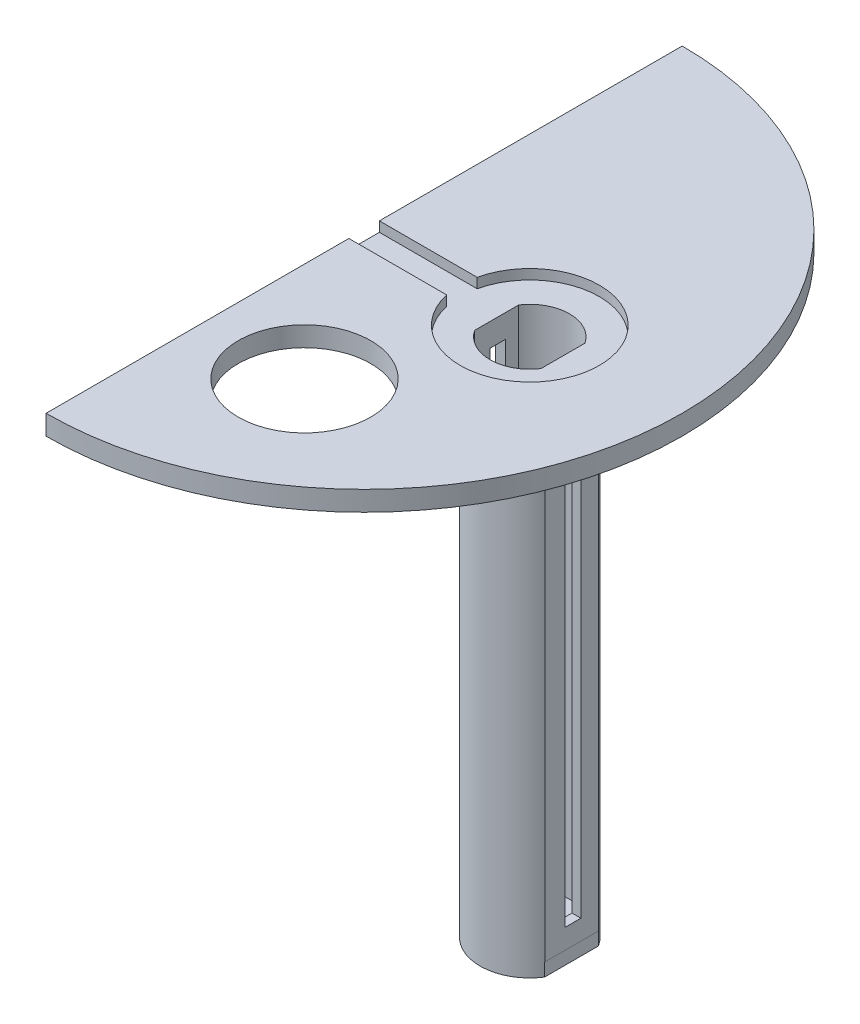
ISO-10303-21;
HEADER;
FILE_DESCRIPTION(('STEP AP214'),'2;1');
FILE_NAME('part.step','',(''),(''),'','','');
FILE_SCHEMA(('AUTOMOTIVE_DESIGN { 1 0 10303 214 1 1 1 1 }'));
ENDSEC;
DATA;
#1=APPLICATION_CONTEXT('core data for automotive mechanical design processes');
#2=APPLICATION_PROTOCOL_DEFINITION('international standard','automotive_design',2000,#1);
#3=PRODUCT_CONTEXT('',#1,'mechanical');
#4=PRODUCT('Part','Part','',(#3));
#5=PRODUCT_RELATED_PRODUCT_CATEGORY('part','',(#4));
#6=PRODUCT_DEFINITION_FORMATION('','',#4);
#7=PRODUCT_DEFINITION_CONTEXT('part definition',#1,'design');
#8=PRODUCT_DEFINITION('design','',#6,#7);
#9=PRODUCT_DEFINITION_SHAPE('','',#8);
#10=(LENGTH_UNIT() NAMED_UNIT(*) SI_UNIT(.MILLI.,.METRE.));
#11=(NAMED_UNIT(*) PLANE_ANGLE_UNIT() SI_UNIT($,.RADIAN.));
#12=(NAMED_UNIT(*) SI_UNIT($,.STERADIAN.) SOLID_ANGLE_UNIT());
#13=UNCERTAINTY_MEASURE_WITH_UNIT(LENGTH_MEASURE(1.E-05),#10,'distance_accuracy_value','');
#14=(GEOMETRIC_REPRESENTATION_CONTEXT(3) GLOBAL_UNCERTAINTY_ASSIGNED_CONTEXT((#13)) GLOBAL_UNIT_ASSIGNED_CONTEXT((#10,
#11,#12)) REPRESENTATION_CONTEXT('',''));
#15=CARTESIAN_POINT('',(0.,0.,0.));
#16=DIRECTION('',(0.,0.,1.));
#17=DIRECTION('',(1.,0.,0.));
#18=AXIS2_PLACEMENT_3D('',#15,#16,#17);
#19=CARTESIAN_POINT('',(0.,0.,0.));
#20=DIRECTION('',(0.,1.,0.));
#21=DIRECTION('',(0.,0.,1.));
#22=AXIS2_PLACEMENT_3D('',#19,#20,#21);
#23=PLANE('',#22);
#24=CARTESIAN_POINT('',(15.,0.,24.));
#25=DIRECTION('',(0.,1.,0.));
#26=DIRECTION('',(0.,0.,1.));
#27=AXIS2_PLACEMENT_3D('',#24,#25,#26);
#28=CIRCLE('',#27,10.);
#29=CARTESIAN_POINT('',(15.,0.,34.));
#30=VERTEX_POINT('',#29);
#31=EDGE_CURVE('E462',#30,#30,#28,.T.);
#32=ORIENTED_EDGE('',*,*,#31,.T.);
#33=EDGE_LOOP('',(#32));
#34=FACE_BOUND('',#33,.T.);
#35=CARTESIAN_POINT('',(0.,0.,0.));
#36=DIRECTION('',(0.,1.,0.));
#37=DIRECTION('',(0.,0.,1.));
#38=AXIS2_PLACEMENT_3D('',#35,#36,#37);
#39=CIRCLE('',#38,48.);
#40=CARTESIAN_POINT('',(0.,0.,48.));
#41=VERTEX_POINT('',#40);
#42=CARTESIAN_POINT('',(0.,0.,-48.));
#43=VERTEX_POINT('',#42);
#44=EDGE_CURVE('E391',#41,#43,#39,.T.);
#45=ORIENTED_EDGE('',*,*,#44,.F.);
#46=DIRECTION('',(0.,0.,1.));
#47=VECTOR('',#46,1.);
#48=CARTESIAN_POINT('',(0.,0.,-48.));
#49=LINE('',#48,#47);
#50=EDGE_CURVE('E401',#43,#41,#49,.T.);
#51=ORIENTED_EDGE('',*,*,#50,.F.);
#52=EDGE_LOOP('',(#45,#51));
#53=FACE_BOUND('',#52,.T.);
#54=CARTESIAN_POINT('',(25.,0.,0.));
#55=DIRECTION('',(0.,-1.,0.));
#56=DIRECTION('',(0.,0.,-1.));
#57=AXIS2_PLACEMENT_3D('',#54,#55,#56);
#58=CIRCLE('',#57,7.5);
#59=CARTESIAN_POINT('',(31.3390528314233,0.,4.0082925542461));
#60=VERTEX_POINT('',#59);
#61=CARTESIAN_POINT('',(18.4235497717257,0.,3.60559320986589));
#62=VERTEX_POINT('',#61);
#63=EDGE_CURVE('E328',#60,#62,#58,.T.);
#64=ORIENTED_EDGE('',*,*,#63,.F.);
#65=DIRECTION('',(0.,0.,-1.));
#66=VECTOR('',#65,1.);
#67=CARTESIAN_POINT('',(31.3390528314233,0.,0.));
#68=LINE('',#67,#66);
#69=CARTESIAN_POINT('',(31.3390528314233,0.,-4.0082925542461));
#70=VERTEX_POINT('',#69);
#71=EDGE_CURVE('E302',#60,#70,#68,.T.);
#72=ORIENTED_EDGE('',*,*,#71,.T.);
#73=CARTESIAN_POINT('',(25.,0.,0.));
#74=DIRECTION('',(0.,-1.,0.));
#75=DIRECTION('',(0.,0.,-1.));
#76=AXIS2_PLACEMENT_3D('',#73,#74,#75);
#77=CIRCLE('',#76,7.5);
#78=CARTESIAN_POINT('',(18.4235497717257,0.,-3.60559320986589));
#79=VERTEX_POINT('',#78);
#80=EDGE_CURVE('E307',#79,#70,#77,.T.);
#81=ORIENTED_EDGE('',*,*,#80,.F.);
#82=DIRECTION('',(0.,0.,-1.));
#83=VECTOR('',#82,1.);
#84=CARTESIAN_POINT('',(18.4235497717257,0.,0.));
#85=LINE('',#84,#83);
#86=EDGE_CURVE('E331',#62,#79,#85,.T.);
#87=ORIENTED_EDGE('',*,*,#86,.F.);
#88=EDGE_LOOP('',(#64,#72,#81,#87));
#89=FACE_BOUND('',#88,.T.);
#90=ADVANCED_FACE('F34',(#34,#53,#89),#23,.F.);
#91=CARTESIAN_POINT('',(0.,3.,0.));
#92=DIRECTION('',(0.,-1.,0.));
#93=DIRECTION('',(0.,0.,-1.));
#94=AXIS2_PLACEMENT_3D('',#91,#92,#93);
#95=CYLINDRICAL_SURFACE('',#94,48.);
#96=ORIENTED_EDGE('',*,*,#44,.T.);
#97=DIRECTION('',(0.,-1.,0.));
#98=VECTOR('',#97,1.);
#99=CARTESIAN_POINT('',(0.,3.,-48.));
#100=LINE('',#99,#98);
#101=CARTESIAN_POINT('',(0.,3.,-48.));
#102=VERTEX_POINT('',#101);
#103=EDGE_CURVE('E11',#102,#43,#100,.T.);
#104=ORIENTED_EDGE('',*,*,#103,.F.);
#105=CARTESIAN_POINT('',(0.,3.,0.));
#106=DIRECTION('',(0.,1.,0.));
#107=DIRECTION('',(0.,0.,1.));
#108=AXIS2_PLACEMENT_3D('',#105,#106,#107);
#109=CIRCLE('',#108,48.);
#110=CARTESIAN_POINT('',(0.,3.,48.));
#111=VERTEX_POINT('',#110);
#112=EDGE_CURVE('E397',#111,#102,#109,.T.);
#113=ORIENTED_EDGE('',*,*,#112,.F.);
#114=DIRECTION('',(0.,-1.,0.));
#115=VECTOR('',#114,1.);
#116=CARTESIAN_POINT('',(0.,3.,48.));
#117=LINE('',#116,#115);
#118=EDGE_CURVE('E42',#111,#41,#117,.T.);
#119=ORIENTED_EDGE('',*,*,#118,.T.);
#120=EDGE_LOOP('',(#96,#104,#113,#119));
#121=FACE_BOUND('',#120,.T.);
#122=ADVANCED_FACE('F36',(#121),#95,.T.);
#123=CARTESIAN_POINT('',(0.,3.,-48.));
#124=DIRECTION('',(1.,0.,0.));
#125=DIRECTION('',(0.,0.,-1.));
#126=AXIS2_PLACEMENT_3D('',#123,#124,#125);
#127=PLANE('',#126);
#128=DIRECTION('',(0.,0.,1.));
#129=VECTOR('',#128,1.);
#130=CARTESIAN_POINT('',(0.,1.5,-2.3));
#131=LINE('',#130,#129);
#132=CARTESIAN_POINT('',(0.,1.5,-2.3));
#133=VERTEX_POINT('',#132);
#134=CARTESIAN_POINT('',(0.,1.5,2.3));
#135=VERTEX_POINT('',#134);
#136=EDGE_CURVE('E368',#133,#135,#131,.T.);
#137=ORIENTED_EDGE('',*,*,#136,.F.);
#138=DIRECTION('',(0.,1.,0.));
#139=VECTOR('',#138,1.);
#140=CARTESIAN_POINT('',(0.,1.5,-2.3));
#141=LINE('',#140,#139);
#142=CARTESIAN_POINT('',(0.,3.,-2.3));
#143=VERTEX_POINT('',#142);
#144=EDGE_CURVE('E388',#133,#143,#141,.T.);
#145=ORIENTED_EDGE('',*,*,#144,.T.);
#146=DIRECTION('',(0.,0.,1.));
#147=VECTOR('',#146,1.);
#148=CARTESIAN_POINT('',(0.,3.,-48.));
#149=LINE('',#148,#147);
#150=EDGE_CURVE('E402',#102,#143,#149,.T.);
#151=ORIENTED_EDGE('',*,*,#150,.F.);
#152=ORIENTED_EDGE('',*,*,#103,.T.);
#153=ORIENTED_EDGE('',*,*,#50,.T.);
#154=ORIENTED_EDGE('',*,*,#118,.F.);
#155=CARTESIAN_POINT('',(0.,3.,2.3));
#156=VERTEX_POINT('',#155);
#157=EDGE_CURVE('E400',#156,#111,#149,.T.);
#158=ORIENTED_EDGE('',*,*,#157,.F.);
#159=DIRECTION('',(0.,1.,0.));
#160=VECTOR('',#159,1.);
#161=CARTESIAN_POINT('',(0.,1.5,2.3));
#162=LINE('',#161,#160);
#163=EDGE_CURVE('E381',#135,#156,#162,.T.);
#164=ORIENTED_EDGE('',*,*,#163,.F.);
#165=EDGE_LOOP('',(#137,#145,#151,#152,#153,#154,#158,#164));
#166=FACE_BOUND('',#165,.T.);
#167=ADVANCED_FACE('F418',(#166),#127,.F.);
#168=CARTESIAN_POINT('',(0.,3.,0.));
#169=DIRECTION('',(0.,1.,0.));
#170=DIRECTION('',(0.,0.,1.));
#171=AXIS2_PLACEMENT_3D('',#168,#169,#170);
#172=PLANE('',#171);
#173=CARTESIAN_POINT('',(15.,3.,24.));
#174=DIRECTION('',(0.,1.,0.));
#175=DIRECTION('',(0.,0.,1.));
#176=AXIS2_PLACEMENT_3D('',#173,#174,#175);
#177=CIRCLE('',#176,10.);
#178=CARTESIAN_POINT('',(15.,3.,34.));
#179=VERTEX_POINT('',#178);
#180=EDGE_CURVE('E460',#179,#179,#177,.T.);
#181=ORIENTED_EDGE('',*,*,#180,.F.);
#182=EDGE_LOOP('',(#181));
#183=FACE_BOUND('',#182,.T.);
#184=DIRECTION('',(-1.,0.,0.));
#185=VECTOR('',#184,1.);
#186=CARTESIAN_POINT('',(14.7550012201075,3.,-2.3));
#187=LINE('',#186,#185);
#188=CARTESIAN_POINT('',(14.7550012201075,3.,-2.3));
#189=VERTEX_POINT('',#188);
#190=EDGE_CURVE('E372',#189,#143,#187,.T.);
#191=ORIENTED_EDGE('',*,*,#190,.F.);
#192=CARTESIAN_POINT('',(25.,3.,0.));
#193=DIRECTION('',(0.,1.,0.));
#194=DIRECTION('',(0.,0.,1.));
#195=AXIS2_PLACEMENT_3D('',#192,#193,#194);
#196=CIRCLE('',#195,10.5);
#197=CARTESIAN_POINT('',(14.7550012201074,3.,2.3));
#198=VERTEX_POINT('',#197);
#199=EDGE_CURVE('E384',#198,#189,#196,.T.);
#200=ORIENTED_EDGE('',*,*,#199,.F.);
#201=DIRECTION('',(1.,0.,0.));
#202=VECTOR('',#201,1.);
#203=CARTESIAN_POINT('',(14.7550012201075,3.,2.3));
#204=LINE('',#203,#202);
#205=EDGE_CURVE('E361',#156,#198,#204,.T.);
#206=ORIENTED_EDGE('',*,*,#205,.F.);
#207=ORIENTED_EDGE('',*,*,#157,.T.);
#208=ORIENTED_EDGE('',*,*,#112,.T.);
#209=ORIENTED_EDGE('',*,*,#150,.T.);
#210=EDGE_LOOP('',(#191,#200,#206,#207,#208,#209));
#211=FACE_BOUND('',#210,.T.);
#212=ADVANCED_FACE('F421',(#183,#211),#172,.T.);
#213=CARTESIAN_POINT('',(14.7550012201075,1.5,-2.3));
#214=DIRECTION('',(0.,0.,-1.));
#215=DIRECTION('',(-1.,0.,0.));
#216=AXIS2_PLACEMENT_3D('',#213,#214,#215);
#217=PLANE('',#216);
#218=ORIENTED_EDGE('',*,*,#190,.T.);
#219=ORIENTED_EDGE('',*,*,#144,.F.);
#220=DIRECTION('',(-1.,0.,0.));
#221=VECTOR('',#220,1.);
#222=CARTESIAN_POINT('',(14.7550012201075,1.5,-2.3));
#223=LINE('',#222,#221);
#224=CARTESIAN_POINT('',(14.7550012201075,1.5,-2.3));
#225=VERTEX_POINT('',#224);
#226=EDGE_CURVE('E378',#225,#133,#223,.T.);
#227=ORIENTED_EDGE('',*,*,#226,.F.);
#228=DIRECTION('',(0.,1.,0.));
#229=VECTOR('',#228,1.);
#230=CARTESIAN_POINT('',(14.7550012201075,1.5,-2.3));
#231=LINE('',#230,#229);
#232=EDGE_CURVE('E392',#225,#189,#231,.T.);
#233=ORIENTED_EDGE('',*,*,#232,.T.);
#234=EDGE_LOOP('',(#218,#219,#227,#233));
#235=FACE_BOUND('',#234,.T.);
#236=ADVANCED_FACE('F432',(#235),#217,.F.);
#237=CARTESIAN_POINT('',(25.,1.5,0.));
#238=DIRECTION('',(0.,1.,0.));
#239=DIRECTION('',(0.,0.,1.));
#240=AXIS2_PLACEMENT_3D('',#237,#238,#239);
#241=CYLINDRICAL_SURFACE('',#240,10.5);
#242=ORIENTED_EDGE('',*,*,#199,.T.);
#243=ORIENTED_EDGE('',*,*,#232,.F.);
#244=CARTESIAN_POINT('',(25.,1.5,0.));
#245=DIRECTION('',(0.,1.,0.));
#246=DIRECTION('',(0.,0.,1.));
#247=AXIS2_PLACEMENT_3D('',#244,#245,#246);
#248=CIRCLE('',#247,10.5);
#249=CARTESIAN_POINT('',(14.7550012201074,1.5,2.3));
#250=VERTEX_POINT('',#249);
#251=EDGE_CURVE('E375',#250,#225,#248,.T.);
#252=ORIENTED_EDGE('',*,*,#251,.F.);
#253=DIRECTION('',(0.,1.,0.));
#254=VECTOR('',#253,1.);
#255=CARTESIAN_POINT('',(14.7550012201074,1.5,2.3));
#256=LINE('',#255,#254);
#257=EDGE_CURVE('E394',#250,#198,#256,.T.);
#258=ORIENTED_EDGE('',*,*,#257,.T.);
#259=EDGE_LOOP('',(#242,#243,#252,#258));
#260=FACE_BOUND('',#259,.T.);
#261=ADVANCED_FACE('F434',(#260),#241,.F.);
#262=CARTESIAN_POINT('',(14.7550012201075,1.5,2.3));
#263=DIRECTION('',(0.,0.,1.));
#264=DIRECTION('',(1.,0.,0.));
#265=AXIS2_PLACEMENT_3D('',#262,#263,#264);
#266=PLANE('',#265);
#267=ORIENTED_EDGE('',*,*,#205,.T.);
#268=ORIENTED_EDGE('',*,*,#257,.F.);
#269=DIRECTION('',(1.,0.,0.));
#270=VECTOR('',#269,1.);
#271=CARTESIAN_POINT('',(14.7550012201075,1.5,2.3));
#272=LINE('',#271,#270);
#273=EDGE_CURVE('E371',#135,#250,#272,.T.);
#274=ORIENTED_EDGE('',*,*,#273,.F.);
#275=ORIENTED_EDGE('',*,*,#163,.T.);
#276=EDGE_LOOP('',(#267,#268,#274,#275));
#277=FACE_BOUND('',#276,.T.);
#278=ADVANCED_FACE('F426',(#277),#266,.F.);
#279=CARTESIAN_POINT('',(25.,1.5,0.));
#280=DIRECTION('',(0.,1.,0.));
#281=DIRECTION('',(0.,0.,1.));
#282=AXIS2_PLACEMENT_3D('',#279,#280,#281);
#283=PLANE('',#282);
#284=CARTESIAN_POINT('',(25.,1.5,0.));
#285=DIRECTION('',(0.,1.,0.));
#286=DIRECTION('',(0.,0.,1.));
#287=AXIS2_PLACEMENT_3D('',#284,#285,#286);
#288=CIRCLE('',#287,6.);
#289=CARTESIAN_POINT('',(20.,1.5,3.3166247903554));
#290=VERTEX_POINT('',#289);
#291=CARTESIAN_POINT('',(30.,1.5,3.31662479035539));
#292=VERTEX_POINT('',#291);
#293=EDGE_CURVE('E347',#290,#292,#288,.T.);
#294=ORIENTED_EDGE('',*,*,#293,.F.);
#295=DIRECTION('',(0.,0.,1.));
#296=VECTOR('',#295,1.);
#297=CARTESIAN_POINT('',(20.,1.5,-3.3166247903554));
#298=LINE('',#297,#296);
#299=CARTESIAN_POINT('',(20.,1.5,-3.3166247903554));
#300=VERTEX_POINT('',#299);
#301=EDGE_CURVE('E355',#300,#290,#298,.T.);
#302=ORIENTED_EDGE('',*,*,#301,.F.);
#303=CARTESIAN_POINT('',(25.,1.5,0.));
#304=DIRECTION('',(0.,1.,0.));
#305=DIRECTION('',(0.,0.,1.));
#306=AXIS2_PLACEMENT_3D('',#303,#304,#305);
#307=CIRCLE('',#306,6.);
#308=CARTESIAN_POINT('',(30.,1.5,-3.3166247903554));
#309=VERTEX_POINT('',#308);
#310=EDGE_CURVE('E352',#309,#300,#307,.T.);
#311=ORIENTED_EDGE('',*,*,#310,.F.);
#312=DIRECTION('',(0.,0.,-1.));
#313=VECTOR('',#312,1.);
#314=CARTESIAN_POINT('',(30.,1.5,-3.3166247903554));
#315=LINE('',#314,#313);
#316=EDGE_CURVE('E349',#292,#309,#315,.T.);
#317=ORIENTED_EDGE('',*,*,#316,.F.);
#318=EDGE_LOOP('',(#294,#302,#311,#317));
#319=FACE_BOUND('',#318,.T.);
#320=ORIENTED_EDGE('',*,*,#136,.T.);
#321=ORIENTED_EDGE('',*,*,#273,.T.);
#322=ORIENTED_EDGE('',*,*,#251,.T.);
#323=ORIENTED_EDGE('',*,*,#226,.T.);
#324=EDGE_LOOP('',(#320,#321,#322,#323));
#325=FACE_BOUND('',#324,.T.);
#326=ADVANCED_FACE('F429',(#319,#325),#283,.T.);
#327=CARTESIAN_POINT('',(25.,-2.5,0.));
#328=DIRECTION('',(0.,1.,0.));
#329=DIRECTION('',(0.,0.,1.));
#330=AXIS2_PLACEMENT_3D('',#327,#328,#329);
#331=CYLINDRICAL_SURFACE('',#330,6.);
#332=DIRECTION('',(0.,1.,0.));
#333=VECTOR('',#332,1.);
#334=CARTESIAN_POINT('',(20.,-2.5,3.3166247903554));
#335=LINE('',#334,#333);
#336=CARTESIAN_POINT('',(20.,-75.,3.3166247903554));
#337=VERTEX_POINT('',#336);
#338=EDGE_CURVE('E359',#337,#290,#335,.T.);
#339=ORIENTED_EDGE('',*,*,#338,.T.);
#340=ORIENTED_EDGE('',*,*,#293,.T.);
#341=DIRECTION('',(0.,1.,0.));
#342=VECTOR('',#341,1.);
#343=CARTESIAN_POINT('',(30.,-2.5,3.31662479035539));
#344=LINE('',#343,#342);
#345=CARTESIAN_POINT('',(30.,-75.,3.31662479035539));
#346=VERTEX_POINT('',#345);
#347=EDGE_CURVE('E358',#346,#292,#344,.T.);
#348=ORIENTED_EDGE('',*,*,#347,.F.);
#349=CARTESIAN_POINT('',(25.,-75.,0.));
#350=DIRECTION('',(0.,-1.,0.));
#351=DIRECTION('',(0.,0.,-1.));
#352=AXIS2_PLACEMENT_3D('',#349,#350,#351);
#353=CIRCLE('',#352,6.);
#354=EDGE_CURVE('E310',#337,#346,#353,.F.);
#355=ORIENTED_EDGE('',*,*,#354,.F.);
#356=EDGE_LOOP('',(#339,#340,#348,#355));
#357=FACE_BOUND('',#356,.T.);
#358=ADVANCED_FACE('F475',(#357),#331,.F.);
#359=CARTESIAN_POINT('',(20.,-2.5,-3.3166247903554));
#360=DIRECTION('',(-1.,0.,0.));
#361=DIRECTION('',(0.,0.,1.));
#362=AXIS2_PLACEMENT_3D('',#359,#360,#361);
#363=PLANE('',#362);
#364=DIRECTION('',(0.,0.,-1.));
#365=VECTOR('',#364,1.);
#366=CARTESIAN_POINT('',(20.,-1.99999999999999,-3.3166247903554));
#367=LINE('',#366,#365);
#368=CARTESIAN_POINT('',(20.,-1.99999999999999,1.02983222913893));
#369=VERTEX_POINT('',#368);
#370=CARTESIAN_POINT('',(20.,-1.99999999999999,-1.37016777086106));
#371=VERTEX_POINT('',#370);
#372=EDGE_CURVE('E260',#369,#371,#367,.T.);
#373=ORIENTED_EDGE('',*,*,#372,.T.);
#374=DIRECTION('',(0.,-1.,0.));
#375=VECTOR('',#374,1.);
#376=CARTESIAN_POINT('',(20.,-2.5,-1.37016777086106));
#377=LINE('',#376,#375);
#378=CARTESIAN_POINT('',(20.,-72.,-1.37016777086106));
#379=VERTEX_POINT('',#378);
#380=EDGE_CURVE('E268',#371,#379,#377,.T.);
#381=ORIENTED_EDGE('',*,*,#380,.T.);
#382=DIRECTION('',(0.,0.,1.));
#383=VECTOR('',#382,1.);
#384=CARTESIAN_POINT('',(20.,-72.,-3.3166247903554));
#385=LINE('',#384,#383);
#386=CARTESIAN_POINT('',(20.,-72.,1.02983222913894));
#387=VERTEX_POINT('',#386);
#388=EDGE_CURVE('E246',#379,#387,#385,.T.);
#389=ORIENTED_EDGE('',*,*,#388,.T.);
#390=DIRECTION('',(0.,1.,0.));
#391=VECTOR('',#390,1.);
#392=CARTESIAN_POINT('',(20.,-2.5,1.02983222913893));
#393=LINE('',#392,#391);
#394=EDGE_CURVE('E212',#387,#369,#393,.T.);
#395=ORIENTED_EDGE('',*,*,#394,.T.);
#396=EDGE_LOOP('',(#373,#381,#389,#395));
#397=FACE_BOUND('',#396,.T.);
#398=DIRECTION('',(0.,1.,0.));
#399=VECTOR('',#398,1.);
#400=CARTESIAN_POINT('',(20.,-2.5,-3.3166247903554));
#401=LINE('',#400,#399);
#402=CARTESIAN_POINT('',(20.,-75.,-3.3166247903554));
#403=VERTEX_POINT('',#402);
#404=EDGE_CURVE('E362',#403,#300,#401,.T.);
#405=ORIENTED_EDGE('',*,*,#404,.T.);
#406=ORIENTED_EDGE('',*,*,#301,.T.);
#407=ORIENTED_EDGE('',*,*,#338,.F.);
#408=DIRECTION('',(0.,0.,1.));
#409=VECTOR('',#408,1.);
#410=CARTESIAN_POINT('',(20.,-75.,0.));
#411=LINE('',#410,#409);
#412=EDGE_CURVE('E306',#403,#337,#411,.T.);
#413=ORIENTED_EDGE('',*,*,#412,.F.);
#414=EDGE_LOOP('',(#405,#406,#407,#413));
#415=FACE_BOUND('',#414,.T.);
#416=ADVANCED_FACE('F471',(#397,#415),#363,.F.);
#417=CARTESIAN_POINT('',(25.,-2.5,0.));
#418=DIRECTION('',(0.,1.,0.));
#419=DIRECTION('',(0.,0.,1.));
#420=AXIS2_PLACEMENT_3D('',#417,#418,#419);
#421=CYLINDRICAL_SURFACE('',#420,6.);
#422=DIRECTION('',(0.,1.,0.));
#423=VECTOR('',#422,1.);
#424=CARTESIAN_POINT('',(30.,-2.5,-3.3166247903554));
#425=LINE('',#424,#423);
#426=CARTESIAN_POINT('',(30.,-75.,-3.3166247903554));
#427=VERTEX_POINT('',#426);
#428=EDGE_CURVE('E364',#427,#309,#425,.T.);
#429=ORIENTED_EDGE('',*,*,#428,.T.);
#430=ORIENTED_EDGE('',*,*,#310,.T.);
#431=ORIENTED_EDGE('',*,*,#404,.F.);
#432=CARTESIAN_POINT('',(25.,-75.,0.));
#433=DIRECTION('',(0.,-1.,0.));
#434=DIRECTION('',(0.,0.,-1.));
#435=AXIS2_PLACEMENT_3D('',#432,#433,#434);
#436=CIRCLE('',#435,6.);
#437=EDGE_CURVE('E303',#427,#403,#436,.F.);
#438=ORIENTED_EDGE('',*,*,#437,.F.);
#439=EDGE_LOOP('',(#429,#430,#431,#438));
#440=FACE_BOUND('',#439,.T.);
#441=ADVANCED_FACE('F474',(#440),#421,.F.);
#442=CARTESIAN_POINT('',(30.,-2.5,-3.3166247903554));
#443=DIRECTION('',(1.,0.,0.));
#444=DIRECTION('',(0.,0.,-1.));
#445=AXIS2_PLACEMENT_3D('',#442,#443,#444);
#446=PLANE('',#445);
#447=DIRECTION('',(0.,0.,-1.));
#448=VECTOR('',#447,1.);
#449=CARTESIAN_POINT('',(30.,-72.,-3.3166247903554));
#450=LINE('',#449,#448);
#451=CARTESIAN_POINT('',(30.,-72.,1.02983222913894));
#452=VERTEX_POINT('',#451);
#453=CARTESIAN_POINT('',(30.,-72.,-1.37016777086106));
#454=VERTEX_POINT('',#453);
#455=EDGE_CURVE('E243',#452,#454,#450,.T.);
#456=ORIENTED_EDGE('',*,*,#455,.T.);
#457=DIRECTION('',(0.,1.,0.));
#458=VECTOR('',#457,1.);
#459=CARTESIAN_POINT('',(30.,-2.5,-1.37016777086106));
#460=LINE('',#459,#458);
#461=CARTESIAN_POINT('',(30.,-1.99999999999999,-1.37016777086106));
#462=VERTEX_POINT('',#461);
#463=EDGE_CURVE('E265',#454,#462,#460,.T.);
#464=ORIENTED_EDGE('',*,*,#463,.T.);
#465=DIRECTION('',(0.,0.,1.));
#466=VECTOR('',#465,1.);
#467=CARTESIAN_POINT('',(30.,-1.99999999999999,-3.3166247903554));
#468=LINE('',#467,#466);
#469=CARTESIAN_POINT('',(30.,-1.99999999999999,1.02983222913893));
#470=VERTEX_POINT('',#469);
#471=EDGE_CURVE('E257',#462,#470,#468,.T.);
#472=ORIENTED_EDGE('',*,*,#471,.T.);
#473=DIRECTION('',(0.,-1.,0.));
#474=VECTOR('',#473,1.);
#475=CARTESIAN_POINT('',(30.,-2.5,1.02983222913893));
#476=LINE('',#475,#474);
#477=EDGE_CURVE('E251',#470,#452,#476,.T.);
#478=ORIENTED_EDGE('',*,*,#477,.T.);
#479=EDGE_LOOP('',(#456,#464,#472,#478));
#480=FACE_BOUND('',#479,.T.);
#481=ORIENTED_EDGE('',*,*,#347,.T.);
#482=ORIENTED_EDGE('',*,*,#316,.T.);
#483=ORIENTED_EDGE('',*,*,#428,.F.);
#484=DIRECTION('',(0.,0.,-1.));
#485=VECTOR('',#484,1.);
#486=CARTESIAN_POINT('',(30.,-75.,0.));
#487=LINE('',#486,#485);
#488=EDGE_CURVE('E313',#346,#427,#487,.T.);
#489=ORIENTED_EDGE('',*,*,#488,.F.);
#490=EDGE_LOOP('',(#481,#482,#483,#489));
#491=FACE_BOUND('',#490,.T.);
#492=ADVANCED_FACE('F489',(#480,#491),#446,.F.);
#493=CARTESIAN_POINT('',(31.3390528314233,-75.,0.));
#494=DIRECTION('',(1.,0.,0.));
#495=DIRECTION('',(0.,0.,-1.));
#496=AXIS2_PLACEMENT_3D('',#493,#494,#495);
#497=PLANE('',#496);
#498=DIRECTION('',(0.,1.,0.));
#499=VECTOR('',#498,1.);
#500=CARTESIAN_POINT('',(31.3390528314233,-75.,-1.37016777086106));
#501=LINE('',#500,#499);
#502=CARTESIAN_POINT('',(31.3390528314233,-72.,-1.37016777086106));
#503=VERTEX_POINT('',#502);
#504=CARTESIAN_POINT('',(31.3390528314233,-1.99999999999999,-1.37016777086106));
#505=VERTEX_POINT('',#504);
#506=EDGE_CURVE('E263',#503,#505,#501,.T.);
#507=ORIENTED_EDGE('',*,*,#506,.F.);
#508=DIRECTION('',(0.,0.,-1.));
#509=VECTOR('',#508,1.);
#510=CARTESIAN_POINT('',(31.3390528314233,-72.,0.));
#511=LINE('',#510,#509);
#512=CARTESIAN_POINT('',(31.3390528314233,-72.,1.02983222913894));
#513=VERTEX_POINT('',#512);
#514=EDGE_CURVE('E241',#513,#503,#511,.T.);
#515=ORIENTED_EDGE('',*,*,#514,.F.);
#516=DIRECTION('',(0.,-1.,0.));
#517=VECTOR('',#516,1.);
#518=CARTESIAN_POINT('',(31.3390528314233,-75.,1.02983222913894));
#519=LINE('',#518,#517);
#520=CARTESIAN_POINT('',(31.3390528314233,-1.99999999999999,1.02983222913893));
#521=VERTEX_POINT('',#520);
#522=EDGE_CURVE('E248',#521,#513,#519,.T.);
#523=ORIENTED_EDGE('',*,*,#522,.F.);
#524=DIRECTION('',(0.,0.,1.));
#525=VECTOR('',#524,1.);
#526=CARTESIAN_POINT('',(31.3390528314233,-1.99999999999999,0.));
#527=LINE('',#526,#525);
#528=EDGE_CURVE('E255',#505,#521,#527,.T.);
#529=ORIENTED_EDGE('',*,*,#528,.F.);
#530=EDGE_LOOP('',(#507,#515,#523,#529));
#531=FACE_BOUND('',#530,.T.);
#532=ORIENTED_EDGE('',*,*,#71,.F.);
#533=DIRECTION('',(0.,1.,0.));
#534=VECTOR('',#533,1.);
#535=CARTESIAN_POINT('',(31.3390528314233,-75.,4.00829255424609));
#536=LINE('',#535,#534);
#537=CARTESIAN_POINT('',(31.3390528314233,-75.,4.00829255424609));
#538=VERTEX_POINT('',#537);
#539=EDGE_CURVE('E344',#538,#60,#536,.T.);
#540=ORIENTED_EDGE('',*,*,#539,.F.);
#541=DIRECTION('',(0.,0.,-1.));
#542=VECTOR('',#541,1.);
#543=CARTESIAN_POINT('',(31.3390528314233,-75.,0.));
#544=LINE('',#543,#542);
#545=CARTESIAN_POINT('',(31.3390528314233,-75.,-4.0082925542461));
#546=VERTEX_POINT('',#545);
#547=EDGE_CURVE('E316',#538,#546,#544,.T.);
#548=ORIENTED_EDGE('',*,*,#547,.T.);
#549=DIRECTION('',(0.,1.,0.));
#550=VECTOR('',#549,1.);
#551=CARTESIAN_POINT('',(31.3390528314233,-75.,-4.0082925542461));
#552=LINE('',#551,#550);
#553=EDGE_CURVE('E326',#546,#70,#552,.T.);
#554=ORIENTED_EDGE('',*,*,#553,.T.);
#555=EDGE_LOOP('',(#532,#540,#548,#554));
#556=FACE_BOUND('',#555,.T.);
#557=ADVANCED_FACE('F527',(#531,#556),#497,.T.);
#558=CARTESIAN_POINT('',(25.,-75.,0.));
#559=DIRECTION('',(0.,1.,0.));
#560=DIRECTION('',(0.,0.,1.));
#561=AXIS2_PLACEMENT_3D('',#558,#559,#560);
#562=CYLINDRICAL_SURFACE('',#561,7.5);
#563=ORIENTED_EDGE('',*,*,#63,.T.);
#564=DIRECTION('',(0.,1.,0.));
#565=VECTOR('',#564,1.);
#566=CARTESIAN_POINT('',(18.4235497717257,-75.,3.60559320986589));
#567=LINE('',#566,#565);
#568=CARTESIAN_POINT('',(18.4235497717257,-75.,3.60559320986589));
#569=VERTEX_POINT('',#568);
#570=EDGE_CURVE('E341',#569,#62,#567,.T.);
#571=ORIENTED_EDGE('',*,*,#570,.F.);
#572=CARTESIAN_POINT('',(25.,-75.,0.));
#573=DIRECTION('',(0.,-1.,0.));
#574=DIRECTION('',(0.,0.,-1.));
#575=AXIS2_PLACEMENT_3D('',#572,#573,#574);
#576=CIRCLE('',#575,7.5);
#577=CARTESIAN_POINT('',(18.4,-75.,3.56230262611138));
#578=VERTEX_POINT('',#577);
#579=EDGE_CURVE('E288',#569,#578,#576,.T.);
#580=ORIENTED_EDGE('',*,*,#579,.T.);
#581=DIRECTION('',(0.,1.,0.));
#582=VECTOR('',#581,1.);
#583=CARTESIAN_POINT('',(18.4,-77.,3.56230262611138));
#584=LINE('',#583,#582);
#585=CARTESIAN_POINT('',(18.4,-77.,3.56230262611138));
#586=VERTEX_POINT('',#585);
#587=EDGE_CURVE('E293',#586,#578,#584,.T.);
#588=ORIENTED_EDGE('',*,*,#587,.F.);
#589=CARTESIAN_POINT('',(25.,-77.,0.));
#590=DIRECTION('',(0.,-1.,0.));
#591=DIRECTION('',(0.,0.,-1.));
#592=AXIS2_PLACEMENT_3D('',#589,#590,#591);
#593=CIRCLE('',#592,7.5);
#594=CARTESIAN_POINT('',(31.3,-77.,4.06939798987516));
#595=VERTEX_POINT('',#594);
#596=EDGE_CURVE('E278',#595,#586,#593,.T.);
#597=ORIENTED_EDGE('',*,*,#596,.F.);
#598=DIRECTION('',(0.,1.,0.));
#599=VECTOR('',#598,1.);
#600=CARTESIAN_POINT('',(31.3,-77.,4.06939798987516));
#601=LINE('',#600,#599);
#602=CARTESIAN_POINT('',(31.3,-75.,4.06939798987516));
#603=VERTEX_POINT('',#602);
#604=EDGE_CURVE('E296',#595,#603,#601,.T.);
#605=ORIENTED_EDGE('',*,*,#604,.T.);
#606=CARTESIAN_POINT('',(25.,-75.,0.));
#607=DIRECTION('',(0.,-1.,0.));
#608=DIRECTION('',(0.,0.,-1.));
#609=AXIS2_PLACEMENT_3D('',#606,#607,#608);
#610=CIRCLE('',#609,7.5);
#611=EDGE_CURVE('E319',#538,#603,#610,.T.);
#612=ORIENTED_EDGE('',*,*,#611,.F.);
#613=ORIENTED_EDGE('',*,*,#539,.T.);
#614=EDGE_LOOP('',(#563,#571,#580,#588,#597,#605,#612,#613));
#615=FACE_BOUND('',#614,.T.);
#616=ADVANCED_FACE('F524',(#615),#562,.T.);
#617=CARTESIAN_POINT('',(18.4235497717257,-75.,0.));
#618=DIRECTION('',(1.,0.,0.));
#619=DIRECTION('',(0.,0.,-1.));
#620=AXIS2_PLACEMENT_3D('',#617,#618,#619);
#621=PLANE('',#620);
#622=DIRECTION('',(0.,0.,1.));
#623=VECTOR('',#622,1.);
#624=CARTESIAN_POINT('',(18.4235497717257,-72.,1.02983222913894));
#625=LINE('',#624,#623);
#626=CARTESIAN_POINT('',(18.4235497717257,-72.,-1.37016777086106));
#627=VERTEX_POINT('',#626);
#628=CARTESIAN_POINT('',(18.4235497717257,-72.,1.02983222913894));
#629=VERTEX_POINT('',#628);
#630=EDGE_CURVE('E218',#627,#629,#625,.T.);
#631=ORIENTED_EDGE('',*,*,#630,.F.);
#632=DIRECTION('',(0.,-1.,0.));
#633=VECTOR('',#632,1.);
#634=CARTESIAN_POINT('',(18.4235497717257,-72.,-1.37016777086106));
#635=LINE('',#634,#633);
#636=CARTESIAN_POINT('',(18.4235497717257,-1.99999999999999,-1.37016777086106));
#637=VERTEX_POINT('',#636);
#638=EDGE_CURVE('E224',#637,#627,#635,.T.);
#639=ORIENTED_EDGE('',*,*,#638,.F.);
#640=DIRECTION('',(0.,0.,-1.));
#641=VECTOR('',#640,1.);
#642=CARTESIAN_POINT('',(18.4235497717257,-1.99999999999999,-1.37016777086106));
#643=LINE('',#642,#641);
#644=CARTESIAN_POINT('',(18.4235497717257,-1.99999999999999,1.02983222913893));
#645=VERTEX_POINT('',#644);
#646=EDGE_CURVE('E229',#645,#637,#643,.T.);
#647=ORIENTED_EDGE('',*,*,#646,.F.);
#648=DIRECTION('',(0.,1.,0.));
#649=VECTOR('',#648,1.);
#650=CARTESIAN_POINT('',(18.4235497717257,-1.99999999999999,1.02983222913893));
#651=LINE('',#650,#649);
#652=EDGE_CURVE('E209',#629,#645,#651,.T.);
#653=ORIENTED_EDGE('',*,*,#652,.F.);
#654=EDGE_LOOP('',(#631,#639,#647,#653));
#655=FACE_BOUND('',#654,.T.);
#656=ORIENTED_EDGE('',*,*,#86,.T.);
#657=DIRECTION('',(0.,1.,0.));
#658=VECTOR('',#657,1.);
#659=CARTESIAN_POINT('',(18.4235497717257,-75.,-3.60559320986589));
#660=LINE('',#659,#658);
#661=CARTESIAN_POINT('',(18.4235497717257,-75.,-3.60559320986589));
#662=VERTEX_POINT('',#661);
#663=EDGE_CURVE('E338',#662,#79,#660,.T.);
#664=ORIENTED_EDGE('',*,*,#663,.F.);
#665=DIRECTION('',(0.,0.,-1.));
#666=VECTOR('',#665,1.);
#667=CARTESIAN_POINT('',(18.4235497717257,-75.,0.));
#668=LINE('',#667,#666);
#669=EDGE_CURVE('E321',#569,#662,#668,.T.);
#670=ORIENTED_EDGE('',*,*,#669,.F.);
#671=ORIENTED_EDGE('',*,*,#570,.T.);
#672=EDGE_LOOP('',(#656,#664,#670,#671));
#673=FACE_BOUND('',#672,.T.);
#674=ADVANCED_FACE('F226',(#655,#673),#621,.F.);
#675=CARTESIAN_POINT('',(25.,-75.,0.));
#676=DIRECTION('',(0.,1.,0.));
#677=DIRECTION('',(0.,0.,1.));
#678=AXIS2_PLACEMENT_3D('',#675,#676,#677);
#679=CYLINDRICAL_SURFACE('',#678,7.5);
#680=ORIENTED_EDGE('',*,*,#80,.T.);
#681=ORIENTED_EDGE('',*,*,#553,.F.);
#682=CARTESIAN_POINT('',(25.,-75.,0.));
#683=DIRECTION('',(0.,-1.,0.));
#684=DIRECTION('',(0.,0.,-1.));
#685=AXIS2_PLACEMENT_3D('',#682,#683,#684);
#686=CIRCLE('',#685,7.5);
#687=CARTESIAN_POINT('',(31.3,-75.,-4.06939798987517));
#688=VERTEX_POINT('',#687);
#689=EDGE_CURVE('E324',#688,#546,#686,.T.);
#690=ORIENTED_EDGE('',*,*,#689,.F.);
#691=DIRECTION('',(0.,1.,0.));
#692=VECTOR('',#691,1.);
#693=CARTESIAN_POINT('',(31.3,-77.,-4.06939798987516));
#694=LINE('',#693,#692);
#695=CARTESIAN_POINT('',(31.3,-77.,-4.06939798987516));
#696=VERTEX_POINT('',#695);
#697=EDGE_CURVE('E299',#696,#688,#694,.T.);
#698=ORIENTED_EDGE('',*,*,#697,.F.);
#699=CARTESIAN_POINT('',(25.,-77.,0.));
#700=DIRECTION('',(0.,-1.,0.));
#701=DIRECTION('',(0.,0.,-1.));
#702=AXIS2_PLACEMENT_3D('',#699,#700,#701);
#703=CIRCLE('',#702,7.5);
#704=CARTESIAN_POINT('',(18.4,-77.,-3.56230262611137));
#705=VERTEX_POINT('',#704);
#706=EDGE_CURVE('E272',#705,#696,#703,.T.);
#707=ORIENTED_EDGE('',*,*,#706,.F.);
#708=DIRECTION('',(0.,1.,0.));
#709=VECTOR('',#708,1.);
#710=CARTESIAN_POINT('',(18.4,-77.,-3.56230262611137));
#711=LINE('',#710,#709);
#712=CARTESIAN_POINT('',(18.4,-75.,-3.56230262611137));
#713=VERTEX_POINT('',#712);
#714=EDGE_CURVE('E282',#705,#713,#711,.T.);
#715=ORIENTED_EDGE('',*,*,#714,.T.);
#716=CARTESIAN_POINT('',(25.,-75.,0.));
#717=DIRECTION('',(0.,-1.,0.));
#718=DIRECTION('',(0.,0.,-1.));
#719=AXIS2_PLACEMENT_3D('',#716,#717,#718);
#720=CIRCLE('',#719,7.5);
#721=EDGE_CURVE('E271',#713,#662,#720,.T.);
#722=ORIENTED_EDGE('',*,*,#721,.T.);
#723=ORIENTED_EDGE('',*,*,#663,.T.);
#724=EDGE_LOOP('',(#680,#681,#690,#698,#707,#715,#722,#723));
#725=FACE_BOUND('',#724,.T.);
#726=ADVANCED_FACE('F517',(#725),#679,.T.);
#727=CARTESIAN_POINT('',(0.,-75.,0.));
#728=DIRECTION('',(0.,-1.,0.));
#729=DIRECTION('',(0.,0.,-1.));
#730=AXIS2_PLACEMENT_3D('',#727,#728,#729);
#731=PLANE('',#730);
#732=DIRECTION('',(0.,0.,1.));
#733=VECTOR('',#732,1.);
#734=CARTESIAN_POINT('',(31.3,-75.,4.06939798987516));
#735=LINE('',#734,#733);
#736=EDGE_CURVE('E285',#688,#603,#735,.T.);
#737=ORIENTED_EDGE('',*,*,#736,.F.);
#738=ORIENTED_EDGE('',*,*,#689,.T.);
#739=ORIENTED_EDGE('',*,*,#547,.F.);
#740=ORIENTED_EDGE('',*,*,#611,.T.);
#741=EDGE_LOOP('',(#737,#738,#739,#740));
#742=FACE_BOUND('',#741,.T.);
#743=ADVANCED_FACE('F514',(#742),#731,.T.);
#744=CARTESIAN_POINT('',(25.,-77.,0.));
#745=DIRECTION('',(0.,-1.,0.));
#746=DIRECTION('',(0.,0.,-1.));
#747=AXIS2_PLACEMENT_3D('',#744,#745,#746);
#748=PLANE('',#747);
#749=ORIENTED_EDGE('',*,*,#706,.T.);
#750=DIRECTION('',(0.,0.,1.));
#751=VECTOR('',#750,1.);
#752=CARTESIAN_POINT('',(31.3,-77.,4.06939798987516));
#753=LINE('',#752,#751);
#754=EDGE_CURVE('E275',#696,#595,#753,.T.);
#755=ORIENTED_EDGE('',*,*,#754,.T.);
#756=ORIENTED_EDGE('',*,*,#596,.T.);
#757=DIRECTION('',(0.,0.,-1.));
#758=VECTOR('',#757,1.);
#759=CARTESIAN_POINT('',(18.4,-77.,3.56230262611137));
#760=LINE('',#759,#758);
#761=EDGE_CURVE('E280',#586,#705,#760,.T.);
#762=ORIENTED_EDGE('',*,*,#761,.T.);
#763=EDGE_LOOP('',(#749,#755,#756,#762));
#764=FACE_BOUND('',#763,.T.);
#765=ADVANCED_FACE('F505',(#764),#748,.T.);
#766=CARTESIAN_POINT('',(18.4,-77.,3.56230262611137));
#767=DIRECTION('',(1.,0.,0.));
#768=DIRECTION('',(0.,0.,-1.));
#769=AXIS2_PLACEMENT_3D('',#766,#767,#768);
#770=PLANE('',#769);
#771=DIRECTION('',(0.,0.,-1.));
#772=VECTOR('',#771,1.);
#773=CARTESIAN_POINT('',(18.4,-75.,3.56230262611137));
#774=LINE('',#773,#772);
#775=EDGE_CURVE('E276',#578,#713,#774,.T.);
#776=ORIENTED_EDGE('',*,*,#775,.T.);
#777=ORIENTED_EDGE('',*,*,#714,.F.);
#778=ORIENTED_EDGE('',*,*,#761,.F.);
#779=ORIENTED_EDGE('',*,*,#587,.T.);
#780=EDGE_LOOP('',(#776,#777,#778,#779));
#781=FACE_BOUND('',#780,.T.);
#782=ADVANCED_FACE('F507',(#781),#770,.F.);
#783=CARTESIAN_POINT('',(31.3,-77.,4.06939798987516));
#784=DIRECTION('',(-1.,0.,0.));
#785=DIRECTION('',(0.,0.,1.));
#786=AXIS2_PLACEMENT_3D('',#783,#784,#785);
#787=PLANE('',#786);
#788=ORIENTED_EDGE('',*,*,#736,.T.);
#789=ORIENTED_EDGE('',*,*,#604,.F.);
#790=ORIENTED_EDGE('',*,*,#754,.F.);
#791=ORIENTED_EDGE('',*,*,#697,.T.);
#792=EDGE_LOOP('',(#788,#789,#790,#791));
#793=FACE_BOUND('',#792,.T.);
#794=ADVANCED_FACE('F501',(#793),#787,.F.);
#795=CARTESIAN_POINT('',(25.,-75.,0.));
#796=DIRECTION('',(0.,-1.,0.));
#797=DIRECTION('',(0.,0.,-1.));
#798=AXIS2_PLACEMENT_3D('',#795,#796,#797);
#799=PLANE('',#798);
#800=ORIENTED_EDGE('',*,*,#579,.F.);
#801=ORIENTED_EDGE('',*,*,#669,.T.);
#802=ORIENTED_EDGE('',*,*,#721,.F.);
#803=ORIENTED_EDGE('',*,*,#775,.F.);
#804=EDGE_LOOP('',(#800,#801,#802,#803));
#805=FACE_BOUND('',#804,.T.);
#806=ADVANCED_FACE('F493',(#805),#799,.F.);
#807=ORIENTED_EDGE('',*,*,#488,.T.);
#808=ORIENTED_EDGE('',*,*,#437,.T.);
#809=ORIENTED_EDGE('',*,*,#412,.T.);
#810=ORIENTED_EDGE('',*,*,#354,.T.);
#811=EDGE_LOOP('',(#807,#808,#809,#810));
#812=FACE_BOUND('',#811,.T.);
#813=ADVANCED_FACE('F491',(#812),#799,.F.);
#814=CARTESIAN_POINT('',(38.4235497717257,-72.,1.02983222913894));
#815=DIRECTION('',(0.,-1.,0.));
#816=DIRECTION('',(0.,0.,-1.));
#817=AXIS2_PLACEMENT_3D('',#814,#815,#816);
#818=PLANE('',#817);
#819=DIRECTION('',(-1.,0.,0.));
#820=VECTOR('',#819,1.);
#821=CARTESIAN_POINT('',(38.4235497717257,-72.,-1.37016777086106));
#822=LINE('',#821,#820);
#823=EDGE_CURVE('E221',#379,#627,#822,.T.);
#824=ORIENTED_EDGE('',*,*,#823,.T.);
#825=ORIENTED_EDGE('',*,*,#630,.T.);
#826=DIRECTION('',(-1.,0.,0.));
#827=VECTOR('',#826,1.);
#828=CARTESIAN_POINT('',(38.4235497717257,-72.,1.02983222913894));
#829=LINE('',#828,#827);
#830=EDGE_CURVE('E49',#387,#629,#829,.T.);
#831=ORIENTED_EDGE('',*,*,#830,.F.);
#832=ORIENTED_EDGE('',*,*,#388,.F.);
#833=EDGE_LOOP('',(#824,#825,#831,#832));
#834=FACE_BOUND('',#833,.T.);
#835=ADVANCED_FACE('F219',(#834),#818,.F.);
#836=CARTESIAN_POINT('',(38.4235497717257,-1.99999999999999,1.02983222913893));
#837=DIRECTION('',(0.,0.,1.));
#838=DIRECTION('',(0.,-1.,0.));
#839=AXIS2_PLACEMENT_3D('',#836,#837,#838);
#840=PLANE('',#839);
#841=ORIENTED_EDGE('',*,*,#830,.T.);
#842=ORIENTED_EDGE('',*,*,#652,.T.);
#843=DIRECTION('',(-1.,0.,0.));
#844=VECTOR('',#843,1.);
#845=CARTESIAN_POINT('',(38.4235497717257,-1.99999999999999,1.02983222913893));
#846=LINE('',#845,#844);
#847=EDGE_CURVE('E238',#369,#645,#846,.T.);
#848=ORIENTED_EDGE('',*,*,#847,.F.);
#849=ORIENTED_EDGE('',*,*,#394,.F.);
#850=EDGE_LOOP('',(#841,#842,#848,#849));
#851=FACE_BOUND('',#850,.T.);
#852=ADVANCED_FACE('F206',(#851),#840,.F.);
#853=CARTESIAN_POINT('',(38.4235497717257,-1.99999999999999,-1.37016777086106));
#854=DIRECTION('',(0.,1.,0.));
#855=DIRECTION('',(0.,0.,1.));
#856=AXIS2_PLACEMENT_3D('',#853,#854,#855);
#857=PLANE('',#856);
#858=ORIENTED_EDGE('',*,*,#847,.T.);
#859=ORIENTED_EDGE('',*,*,#646,.T.);
#860=DIRECTION('',(-1.,0.,0.));
#861=VECTOR('',#860,1.);
#862=CARTESIAN_POINT('',(38.4235497717257,-1.99999999999999,-1.37016777086106));
#863=LINE('',#862,#861);
#864=EDGE_CURVE('E234',#371,#637,#863,.T.);
#865=ORIENTED_EDGE('',*,*,#864,.F.);
#866=ORIENTED_EDGE('',*,*,#372,.F.);
#867=EDGE_LOOP('',(#858,#859,#865,#866));
#868=FACE_BOUND('',#867,.T.);
#869=ADVANCED_FACE('F469',(#868),#857,.F.);
#870=CARTESIAN_POINT('',(38.4235497717257,-72.,-1.37016777086106));
#871=DIRECTION('',(0.,0.,-1.));
#872=DIRECTION('',(-1.,0.,0.));
#873=AXIS2_PLACEMENT_3D('',#870,#871,#872);
#874=PLANE('',#873);
#875=ORIENTED_EDGE('',*,*,#864,.T.);
#876=ORIENTED_EDGE('',*,*,#638,.T.);
#877=ORIENTED_EDGE('',*,*,#823,.F.);
#878=ORIENTED_EDGE('',*,*,#380,.F.);
#879=EDGE_LOOP('',(#875,#876,#877,#878));
#880=FACE_BOUND('',#879,.T.);
#881=ADVANCED_FACE('F466',(#880),#874,.F.);
#882=EDGE_CURVE('E57',#503,#454,#822,.T.);
#883=ORIENTED_EDGE('',*,*,#882,.F.);
#884=ORIENTED_EDGE('',*,*,#506,.T.);
#885=EDGE_CURVE('E236',#505,#462,#863,.T.);
#886=ORIENTED_EDGE('',*,*,#885,.T.);
#887=ORIENTED_EDGE('',*,*,#463,.F.);
#888=EDGE_LOOP('',(#883,#884,#886,#887));
#889=FACE_BOUND('',#888,.T.);
#890=ADVANCED_FACE('F633',(#889),#874,.F.);
#891=ORIENTED_EDGE('',*,*,#885,.F.);
#892=ORIENTED_EDGE('',*,*,#528,.T.);
#893=EDGE_CURVE('E237',#521,#470,#846,.T.);
#894=ORIENTED_EDGE('',*,*,#893,.T.);
#895=ORIENTED_EDGE('',*,*,#471,.F.);
#896=EDGE_LOOP('',(#891,#892,#894,#895));
#897=FACE_BOUND('',#896,.T.);
#898=ADVANCED_FACE('F626',(#897),#857,.F.);
#899=ORIENTED_EDGE('',*,*,#893,.F.);
#900=ORIENTED_EDGE('',*,*,#522,.T.);
#901=EDGE_CURVE('E214',#513,#452,#829,.T.);
#902=ORIENTED_EDGE('',*,*,#901,.T.);
#903=ORIENTED_EDGE('',*,*,#477,.F.);
#904=EDGE_LOOP('',(#899,#900,#902,#903));
#905=FACE_BOUND('',#904,.T.);
#906=ADVANCED_FACE('F618',(#905),#840,.F.);
#907=ORIENTED_EDGE('',*,*,#901,.F.);
#908=ORIENTED_EDGE('',*,*,#514,.T.);
#909=ORIENTED_EDGE('',*,*,#882,.T.);
#910=ORIENTED_EDGE('',*,*,#455,.F.);
#911=EDGE_LOOP('',(#907,#908,#909,#910));
#912=FACE_BOUND('',#911,.T.);
#913=ADVANCED_FACE('F500',(#912),#818,.F.);
#914=CARTESIAN_POINT('',(15.,-1.,24.));
#915=DIRECTION('',(0.,1.,0.));
#916=DIRECTION('',(0.,0.,1.));
#917=AXIS2_PLACEMENT_3D('',#914,#915,#916);
#918=CYLINDRICAL_SURFACE('',#917,10.);
#919=ORIENTED_EDGE('',*,*,#180,.T.);
#920=EDGE_LOOP('',(#919));
#921=FACE_BOUND('',#920,.T.);
#922=ORIENTED_EDGE('',*,*,#31,.F.);
#923=EDGE_LOOP('',(#922));
#924=FACE_BOUND('',#923,.T.);
#925=ADVANCED_FACE('F661',(#921,#924),#918,.F.);
#926=CLOSED_SHELL('',(#90,#122,#167,#212,#236,#261,#278,#326,#358,#416,#441,#492,#557,#616,#674,
#726,#743,#765,#782,#794,#806,#813,#835,#852,#869,#881,#890,#898,#906,#913,#925));
#927=MANIFOLD_SOLID_BREP('B2',#926);
#928=ADVANCED_BREP_SHAPE_REPRESENTATION('',(#18,#927),#14);
#929=SHAPE_DEFINITION_REPRESENTATION(#9,#928);
ENDSEC;
END-ISO-10303-21;
